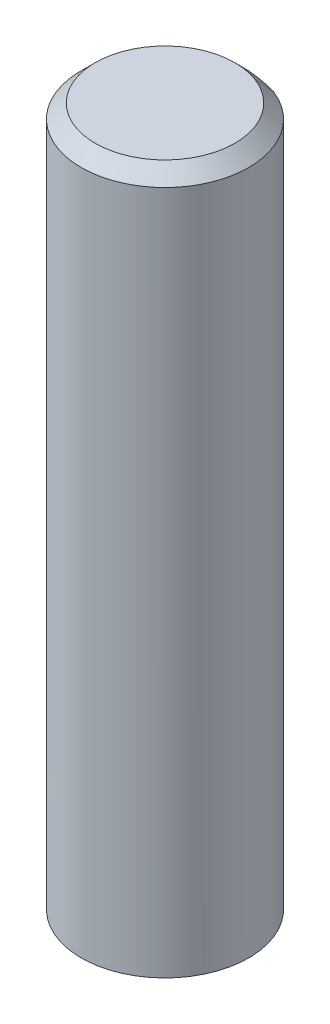
ISO-10303-21;
HEADER;
FILE_DESCRIPTION(('STEP AP214'),'2;1');
FILE_NAME('part.step','',(''),(''),'','','');
FILE_SCHEMA(('AUTOMOTIVE_DESIGN { 1 0 10303 214 1 1 1 1 }'));
ENDSEC;
DATA;
#1=APPLICATION_CONTEXT('core data for automotive mechanical design processes');
#2=APPLICATION_PROTOCOL_DEFINITION('international standard','automotive_design',2000,#1);
#3=PRODUCT_CONTEXT('',#1,'mechanical');
#4=PRODUCT('Part','Part','',(#3));
#5=PRODUCT_RELATED_PRODUCT_CATEGORY('part','',(#4));
#6=PRODUCT_DEFINITION_FORMATION('','',#4);
#7=PRODUCT_DEFINITION_CONTEXT('part definition',#1,'design');
#8=PRODUCT_DEFINITION('design','',#6,#7);
#9=PRODUCT_DEFINITION_SHAPE('','',#8);
#10=(LENGTH_UNIT() NAMED_UNIT(*) SI_UNIT(.MILLI.,.METRE.));
#11=(NAMED_UNIT(*) PLANE_ANGLE_UNIT() SI_UNIT($,.RADIAN.));
#12=(NAMED_UNIT(*) SI_UNIT($,.STERADIAN.) SOLID_ANGLE_UNIT());
#13=UNCERTAINTY_MEASURE_WITH_UNIT(LENGTH_MEASURE(1.E-05),#10,'distance_accuracy_value','');
#14=(GEOMETRIC_REPRESENTATION_CONTEXT(3) GLOBAL_UNCERTAINTY_ASSIGNED_CONTEXT((#13)) GLOBAL_UNIT_ASSIGNED_CONTEXT((#10,
#11,#12)) REPRESENTATION_CONTEXT('',''));
#15=CARTESIAN_POINT('',(0.,0.,0.));
#16=DIRECTION('',(0.,0.,1.));
#17=DIRECTION('',(1.,0.,0.));
#18=AXIS2_PLACEMENT_3D('',#15,#16,#17);
#19=CARTESIAN_POINT('',(3.96266032970383E-06,24.4970015062336,1.41741565208055E-06));
#20=DIRECTION('',(0.,-1.,0.));
#21=DIRECTION('',(1.,0.,0.));
#22=AXIS2_PLACEMENT_3D('',#19,#20,#21);
#23=CONICAL_SURFACE('',#22,3.00299983993226,0.785402046705377);
#24=CARTESIAN_POINT('',(0.897527026142766,24.9999987696679,-2.33333218496535));
#25=CARTESIAN_POINT('',(0.905006429369123,24.9791655616081,-2.3527766656029));
#26=CARTESIAN_POINT('',(0.912485833277227,24.9583323535484,-2.37222114597821));
#27=CARTESIAN_POINT('',(0.927444642456931,24.9166659374289,-2.41111010620437));
#28=CARTESIAN_POINT('',(0.934924047728531,24.8958327293692,-2.43055458605521));
#29=CARTESIAN_POINT('',(0.949882859635227,24.8541663132497,-2.46944354523242));
#30=CARTESIAN_POINT('',(0.957362266270322,24.8333331051899,-2.48888802455879));
#31=CARTESIAN_POINT('',(0.972321080904009,24.7916666890705,-2.52777698268705));
#32=CARTESIAN_POINT('',(0.9798004889026,24.7708334810107,-2.54722146148895));
#33=CARTESIAN_POINT('',(0.994759306263277,24.7291670648913,-2.58611041856826));
#34=CARTESIAN_POINT('',(1.00223871562536,24.7083338568315,-2.60555489684568));
#35=CARTESIAN_POINT('',(1.01719753571303,24.666667440712,-2.64444385287605));
#36=CARTESIAN_POINT('',(1.02467694643861,24.6458342326523,-2.663888330629));
#37=CARTESIAN_POINT('',(1.03963576925327,24.6041678165328,-2.70277728561042));
#38=CARTESIAN_POINT('',(1.04711518134235,24.5833346084731,-2.72222176283889));
#39=CARTESIAN_POINT('',(1.062074006884,24.5416681923536,-2.76111071677136));
#40=CARTESIAN_POINT('',(1.06955342033658,24.5208349842939,-2.78055519347536));
#41=CARTESIAN_POINT('',(1.0770328344709,24.5000017762341,-2.79999966991713));
#42=B_SPLINE_CURVE_WITH_KNOTS('',3,(#24,#25,#26,#27,#28,#29,#30,#31,#32,#33,#34,#35,#36,#37,#38,
#39,#40,#41),.UNSPECIFIED.,.F.,.F.,(4,2,2,2,2,2,2,2,4),(0.,0.0883881593966204,0.176776318793246,
0.265164478189871,0.353552637586502,0.441940796983131,0.530328956379764,0.618717115776401,
0.707105275173039),.UNSPECIFIED.);
#43=CARTESIAN_POINT('',(0.897526350395609,25.0000045074357,-2.3333368513676));
#44=VERTEX_POINT('',#43);
#45=CARTESIAN_POINT('',(1.07703242534803,24.5000062453026,-2.80000494365683));
#46=VERTEX_POINT('',#45);
#47=EDGE_CURVE('E33',#44,#46,#42,.T.);
#48=ORIENTED_EDGE('',*,*,#47,.T.);
#49=CARTESIAN_POINT('',(-1.07702837389864,24.5000002242888,-2.8));
#50=CARTESIAN_POINT('',(-0.988361503666712,24.5318607765706,-2.8));
#51=CARTESIAN_POINT('',(-0.898500591624331,24.5606729607833,-2.8));
#52=CARTESIAN_POINT('',(-0.716574744978598,24.6110759656766,-2.8));
#53=CARTESIAN_POINT('',(-0.62450535431952,24.6326505885143,-2.8));
#54=CARTESIAN_POINT('',(-0.441821941169993,24.6667275305204,-2.8));
#55=CARTESIAN_POINT('',(-0.351260782347426,24.6795067758955,-2.8));
#56=CARTESIAN_POINT('',(-0.169421208914261,24.6963352620021,-2.8));
#57=CARTESIAN_POINT('',(-0.0781437253270295,24.7003943974181,-2.8));
#58=CARTESIAN_POINT('',(0.10225633535318,24.6995508164255,-2.8));
#59=CARTESIAN_POINT('',(0.191379950969372,24.6948530941284,-2.8));
#60=CARTESIAN_POINT('',(0.368888279603076,24.6771875883131,-2.8));
#61=CARTESIAN_POINT('',(0.457272098342766,24.6642109468657,-2.8));
#62=CARTESIAN_POINT('',(0.635504288636282,24.6301635588202,-2.8));
#63=CARTESIAN_POINT('',(0.725302563913348,24.60883627128,-2.8));
#64=CARTESIAN_POINT('',(0.902785604201654,24.559297685735,-2.8));
#65=CARTESIAN_POINT('',(0.990474483112094,24.5311012261688,-2.8));
#66=CARTESIAN_POINT('',(1.07703095283914,24.5000021436772,-2.8));
#67=B_SPLINE_CURVE_WITH_KNOTS('',3,(#49,#50,#51,#52,#53,#54,#55,#56,#57,#58,#59,#60,#61,#62,#63,
#64,#65,#66),.UNSPECIFIED.,.F.,.F.,(4,2,2,2,2,2,2,2,4),(0.,0.282737314065222,0.56610324434768,
0.840079740268704,1.11374519125554,1.38108456230936,1.64871045068094,1.92530000808298,
2.20129730752298),.UNSPECIFIED.);
#68=CARTESIAN_POINT('',(-1.07703245897986,24.5000116030541,-2.79999875399439));
#69=VERTEX_POINT('',#68);
#70=EDGE_CURVE('E58',#69,#46,#67,.T.);
#71=ORIENTED_EDGE('',*,*,#70,.F.);
#72=CARTESIAN_POINT('',(-1.07702837341113,24.5000112303096,-2.79998820792932));
#73=CARTESIAN_POINT('',(-1.06954908170965,24.520844146978,-2.78054399660054));
#74=CARTESIAN_POINT('',(-1.06206978932644,24.5416770636465,-2.761099785534));
#75=CARTESIAN_POINT('',(-1.04711120319657,24.5833428969835,-2.72221136392538));
#76=CARTESIAN_POINT('',(-1.0396319094499,24.604175813652,-2.7027671533833));
#77=CARTESIAN_POINT('',(-1.02467332059312,24.6458416469889,-2.6638787328236));
#78=CARTESIAN_POINT('',(-1.017194025483,24.6666745636574,-2.64443452280598));
#79=CARTESIAN_POINT('',(-1.00223543389931,24.7083403969944,-2.60554610329519));
#80=CARTESIAN_POINT('',(-0.994756137425734,24.7291733136628,-2.58610189380203));
#81=CARTESIAN_POINT('',(-0.97979754311513,24.7708391469998,-2.54721347534017));
#82=CARTESIAN_POINT('',(-0.9723182452781,24.7916720636683,-2.52776926637147));
#83=CARTESIAN_POINT('',(-0.957359648240587,24.8333378970052,-2.48888084895852));
#84=CARTESIAN_POINT('',(-0.949880349040104,24.8541708136737,-2.46943664051428));
#85=CARTESIAN_POINT('',(-0.934921749275681,24.8958366470107,-2.43054822415026));
#86=CARTESIAN_POINT('',(-0.927442448711741,24.9166695636791,-2.41110401623048));
#87=CARTESIAN_POINT('',(-0.912483846220408,24.9583353970161,-2.37221560091537));
#88=CARTESIAN_POINT('',(-0.905004544293014,24.9791683136846,-2.35277139352005));
#89=CARTESIAN_POINT('',(-0.897525241683894,25.0000012303531,-2.33332718638696));
#90=B_SPLINE_CURVE_WITH_KNOTS('',3,(#72,#73,#74,#75,#76,#77,#78,#79,#80,#81,#82,#83,#84,#85,#86,
#87,#88,#89),.UNSPECIFIED.,.F.,.F.,(4,2,2,2,2,2,2,2,4),(0.,0.0883869231234219,0.176773846246841,
0.265160769370258,0.35354769249367,0.441934615617082,0.530321538740491,0.618708461863899,
0.707095384987304),.UNSPECIFIED.);
#91=CARTESIAN_POINT('',(-0.89754478982708,25.00000366244,-2.33332540171722));
#92=VERTEX_POINT('',#91);
#93=EDGE_CURVE('E127',#69,#92,#90,.T.);
#94=ORIENTED_EDGE('',*,*,#93,.T.);
#95=CARTESIAN_POINT('',(3.96266032970383E-06,25.,1.41741565323415E-06));
#96=DIRECTION('',(0.,1.,0.));
#97=DIRECTION('',(0.,0.,1.));
#98=AXIS2_PLACEMENT_3D('',#95,#96,#97);
#99=CIRCLE('',#98,2.49999743955459);
#100=EDGE_CURVE('E59',#44,#92,#99,.T.);
#101=ORIENTED_EDGE('',*,*,#100,.F.);
#102=EDGE_LOOP('',(#48,#71,#94,#101));
#103=FACE_BOUND('',#102,.T.);
#104=ADVANCED_FACE('F15',(#103),#23,.T.);
#105=CARTESIAN_POINT('',(0.,25.,0.));
#106=DIRECTION('',(0.,1.,0.));
#107=DIRECTION('',(0.,0.,1.));
#108=AXIS2_PLACEMENT_3D('',#105,#106,#107);
#109=PLANE('',#108);
#110=ORIENTED_EDGE('',*,*,#100,.T.);
#111=CARTESIAN_POINT('',(-4.41605694229922E-06,25.,-2.31559280090398E-05));
#112=DIRECTION('',(0.,1.,0.));
#113=DIRECTION('',(0.,0.,1.));
#114=AXIS2_PLACEMENT_3D('',#111,#112,#113);
#115=CIRCLE('',#114,2.49999585677121);
#116=EDGE_CURVE('E67',#44,#92,#115,.F.);
#117=ORIENTED_EDGE('',*,*,#116,.F.);
#118=EDGE_LOOP('',(#110,#117));
#119=FACE_BOUND('',#118,.T.);
#120=ADVANCED_FACE('F135',(#119),#109,.T.);
#121=CARTESIAN_POINT('',(0.,0.,0.));
#122=DIRECTION('',(0.,1.,0.));
#123=DIRECTION('',(0.,0.,1.));
#124=AXIS2_PLACEMENT_3D('',#121,#122,#123);
#125=PLANE('',#124);
#126=CARTESIAN_POINT('',(0.,0.,0.));
#127=DIRECTION('',(0.,1.,0.));
#128=DIRECTION('',(0.,0.,1.));
#129=AXIS2_PLACEMENT_3D('',#126,#127,#128);
#130=CIRCLE('',#129,3.);
#131=CARTESIAN_POINT('',(-1.0770329614269,0.,-2.8));
#132=VERTEX_POINT('',#131);
#133=CARTESIAN_POINT('',(1.0770329614269,0.,-2.8));
#134=VERTEX_POINT('',#133);
#135=EDGE_CURVE('E61',#132,#134,#130,.T.);
#136=ORIENTED_EDGE('',*,*,#135,.F.);
#137=DIRECTION('',(-1.,0.,0.));
#138=VECTOR('',#137,1.);
#139=CARTESIAN_POINT('',(1.0770329614269,0.,-2.8));
#140=LINE('',#139,#138);
#141=EDGE_CURVE('E50',#134,#132,#140,.T.);
#142=ORIENTED_EDGE('',*,*,#141,.F.);
#143=EDGE_LOOP('',(#136,#142));
#144=FACE_BOUND('',#143,.T.);
#145=ADVANCED_FACE('F62',(#144),#125,.F.);
#146=CARTESIAN_POINT('',(1.0770329614269,0.,-2.8));
#147=DIRECTION('',(0.,0.,-1.));
#148=DIRECTION('',(-1.,0.,0.));
#149=AXIS2_PLACEMENT_3D('',#146,#147,#148);
#150=PLANE('',#149);
#151=DIRECTION('',(0.,1.,0.));
#152=VECTOR('',#151,1.);
#153=CARTESIAN_POINT('',(-1.0770329614269,0.,-2.8));
#154=LINE('',#153,#152);
#155=EDGE_CURVE('E54',#69,#132,#154,.F.);
#156=ORIENTED_EDGE('',*,*,#155,.F.);
#157=ORIENTED_EDGE('',*,*,#70,.T.);
#158=DIRECTION('',(0.,1.,0.));
#159=VECTOR('',#158,1.);
#160=CARTESIAN_POINT('',(1.0770329614269,0.,-2.8));
#161=LINE('',#160,#159);
#162=EDGE_CURVE('E25',#134,#46,#161,.T.);
#163=ORIENTED_EDGE('',*,*,#162,.F.);
#164=ORIENTED_EDGE('',*,*,#141,.T.);
#165=EDGE_LOOP('',(#156,#157,#163,#164));
#166=FACE_BOUND('',#165,.T.);
#167=ADVANCED_FACE('F52',(#166),#150,.T.);
#168=CARTESIAN_POINT('',(-4.41605694229922E-06,24.5000115080529,-2.31559280090398E-05));
#169=DIRECTION('',(0.,-1.,0.));
#170=DIRECTION('',(0.,0.,-1.));
#171=AXIS2_PLACEMENT_3D('',#168,#169,#170);
#172=CONICAL_SURFACE('',#171,2.99998847092447,0.785402285681521);
#173=ORIENTED_EDGE('',*,*,#47,.F.);
#174=ORIENTED_EDGE('',*,*,#116,.T.);
#175=ORIENTED_EDGE('',*,*,#93,.F.);
#176=CARTESIAN_POINT('',(1.07703083799338,24.5000200056775,-2.80000081678761));
#177=CARTESIAN_POINT('',(1.14639955240836,24.5000196976141,-2.77331842198067));
#178=CARTESIAN_POINT('',(1.214752418303,24.5000193712036,-2.74406530991699));
#179=CARTESIAN_POINT('',(1.34909178053737,24.5000186833819,-2.68057319634131));
#180=CARTESIAN_POINT('',(1.4150785603789,24.5000183219748,-2.64633479466581));
#181=CARTESIAN_POINT('',(1.60896583778062,24.5000171879536,-2.53639085168125));
#182=CARTESIAN_POINT('',(1.7328439086266,24.5000163653142,-2.45343705591407));
#183=CARTESIAN_POINT('',(1.98268586722451,24.5000144870734,-2.25774534160753));
#184=CARTESIAN_POINT('',(2.10668913662099,24.5000134150204,-2.14250207150679));
#185=CARTESIAN_POINT('',(2.33358903156711,24.5000111539231,-1.89283308051105));
#186=CARTESIAN_POINT('',(2.43648517577291,24.5000099648761,-1.75840692227258));
#187=CARTESIAN_POINT('',(2.61824371659059,24.5000075036077,-1.4741950985176));
#188=CARTESIAN_POINT('',(2.69710749442836,24.5000062313911,-1.32441031637759));
#189=CARTESIAN_POINT('',(2.82857617823767,24.5000036397211,-1.01371285186865));
#190=CARTESIAN_POINT('',(2.88117866319533,24.5000023202633,-0.852799145086709));
#191=CARTESIAN_POINT('',(2.95861977755237,24.4999996717087,-0.524427841090968));
#192=CARTESIAN_POINT('',(2.98345901661094,24.499998342612,-0.356970387656307));
#193=CARTESIAN_POINT('',(3.00467002753436,24.4999957125458,-0.0202703189590446));
#194=CARTESIAN_POINT('',(3.00104317277234,24.4999944115749,0.148972209787515));
#195=CARTESIAN_POINT('',(2.96542795062729,24.499991874603,0.484448924722978));
#196=CARTESIAN_POINT('',(2.93343915119405,24.499990638603,0.650683065044388));
#197=CARTESIAN_POINT('',(2.84200667197843,24.4999882666587,0.975424417137711));
#198=CARTESIAN_POINT('',(2.78256250405069,24.4999871307163,1.13393149147011));
#199=CARTESIAN_POINT('',(2.63790704781624,24.4999849911646,1.43871497419215));
#200=CARTESIAN_POINT('',(2.55269591738303,24.4999839875546,1.5849914575113));
#201=CARTESIAN_POINT('',(2.35892585270392,24.499982141154,1.86116170037487));
#202=CARTESIAN_POINT('',(2.25036704748831,24.4999812983626,1.99105555045118));
#203=CARTESIAN_POINT('',(2.01298276341998,24.4999797975145,2.23077443070964));
#204=CARTESIAN_POINT('',(1.88415724389509,24.4999791394582,2.34059942061571));
#205=CARTESIAN_POINT('',(1.60989645288285,24.4999780267617,2.5370628026253));
#206=CARTESIAN_POINT('',(1.4644611562726,24.4999775721219,2.62370115965752));
#207=CARTESIAN_POINT('',(1.16110954468651,24.4999768791656,2.77133160152801));
#208=CARTESIAN_POINT('',(1.00319323701364,24.499976640849,2.83232370137246));
#209=CARTESIAN_POINT('',(0.679362365590126,24.4999763873037,2.92693029929002));
#210=CARTESIAN_POINT('',(0.51344780457783,24.499976372075,2.9605448067363));
#211=CARTESIAN_POINT('',(0.178330169150345,24.4999765651375,2.99944204182843));
#212=CARTESIAN_POINT('',(0.00912709410622289,24.4999767734289,3.00472476405573));
#213=CARTESIAN_POINT('',(-0.327764353644968,24.499977407619,2.98680845347996));
#214=CARTESIAN_POINT('',(-0.495452726412884,24.4999778335178,2.96360942182105));
#215=CARTESIAN_POINT('',(-0.824554565136926,24.499978890833,2.88938816490794));
#216=CARTESIAN_POINT('',(-0.985968032296718,24.4999795222493,2.83836594499088));
#217=CARTESIAN_POINT('',(-1.29793810839815,24.4999809726763,2.70994665799899));
#218=CARTESIAN_POINT('',(-1.44849471273836,24.499981791687,2.63254957974586));
#219=CARTESIAN_POINT('',(-1.73447719821352,24.499983594054,2.45357761234159));
#220=CARTESIAN_POINT('',(-1.86990307179649,24.4999845774105,2.35200271112302));
#221=CARTESIAN_POINT('',(-2.12177948133402,24.4999866805531,2.1275586954249));
#222=CARTESIAN_POINT('',(-2.23823004427138,24.4999878003391,2.00468961122609));
#223=CARTESIAN_POINT('',(-2.44885024972549,24.4999901445533,1.74114518460063));
#224=CARTESIAN_POINT('',(-2.54301992026297,24.4999913689815,1.60046986456768));
#225=CARTESIAN_POINT('',(-2.70640566075626,24.4999938877289,1.3053056032449));
#226=CARTESIAN_POINT('',(-2.77562163246046,24.4999951820485,1.15081660756871));
#227=CARTESIAN_POINT('',(-2.88713472858294,24.4999978038349,0.832410660159991));
#228=CARTESIAN_POINT('',(-2.92943179954151,24.4999991313019,0.668493689704642));
#229=CARTESIAN_POINT('',(-2.98590592213004,24.5000017816873,0.335886536391103));
#230=CARTESIAN_POINT('',(-3.00008319616221,24.5000031046056,0.167196391295115));
#231=CARTESIAN_POINT('',(-2.99991606682034,24.500005708355,-0.170170313007713));
#232=CARTESIAN_POINT('',(-2.98557156308473,24.5000069891859,-0.338846872164658));
#233=CARTESIAN_POINT('',(-2.92876740154068,24.5000094723984,-0.671397955346277));
#234=CARTESIAN_POINT('',(-2.88630771922556,24.50001067478,-0.835272475185107));
#235=CARTESIAN_POINT('',(-2.77448308690542,24.5000129668959,-1.1535581986319));
#236=CARTESIAN_POINT('',(-2.70511954802241,24.5000140566362,-1.30796989807817));
#237=CARTESIAN_POINT('',(-2.54144124613979,24.5000160927306,-1.60297493691207));
#238=CARTESIAN_POINT('',(-2.44712388844759,24.5000170390698,-1.74356683723381));
#239=CARTESIAN_POINT('',(-2.2362079220289,24.5000187615815,-2.00695354870765));
#240=CARTESIAN_POINT('',(-2.1196021842573,24.5000195376993,-2.12974264338904));
#241=CARTESIAN_POINT('',(-1.86744988321831,24.5000208970286,-2.35394065034324));
#242=CARTESIAN_POINT('',(-1.73191748709122,24.5000214803832,-2.45536541328162));
#243=CARTESIAN_POINT('',(-1.50787317320149,24.5000222305474,-2.59528150595081));
#244=CARTESIAN_POINT('',(-1.42439388862975,24.5000224683714,-2.64201347020151));
#245=CARTESIAN_POINT('',(-1.25350955216347,24.5000228746236,-2.72723537796486));
#246=CARTESIAN_POINT('',(-1.16611153464439,24.500023043171,-2.76573942679776));
#247=CARTESIAN_POINT('',(-1.07703294126251,24.5000231764907,-2.80000000775633));
#248=B_SPLINE_CURVE_WITH_KNOTS('',3,(#176,#177,#178,#179,#180,#181,#182,#183,#184,#185,#186,
#187,#188,#189,#190,#191,#192,#193,#194,#195,#196,#197,#198,#199,#200,#201,#202,#203,#204,#205,
#206,#207,#208,#209,#210,#211,#212,#213,#214,#215,#216,#217,#218,#219,#220,#221,#222,#223,#224,
#225,#226,#227,#228,#229,#230,#231,#232,#233,#234,#235,#236,#237,#238,#239,#240,#241,#242,#243,
#244,#245,#246,#247),.UNSPECIFIED.,.F.,.F.,(4,2,2,2,2,2,2,2,2,2,2,2,2,2,2,2,2,2,2,2,2,2,2,2,2,2,
2,2,2,2,2,2,2,2,2,4),(0.,0.222868739287643,0.445710684844992,0.891233408245812,1.39668144035781,
1.90214099783131,2.4075714992577,2.91304858743813,3.41851457551829,3.92395617707214,
4.42940547837659,4.93486376671134,5.44031895817908,5.94577135633442,6.45122476886802,
6.9566789459286,7.46213282723658,7.96758653549396,8.47304034042098,8.97849412504326,
9.48394781270779,9.98940171459627,10.4948558687635,11.0003093041712,11.5057621039108,
12.0112168937765,12.5166726874493,13.0221244834074,13.5275780579374,14.0330320730481,
14.5384595804035,15.0439396626684,15.5495816965329,16.0548472517712,16.3414645580591,
16.6275864956697),.UNSPECIFIED.);
#249=EDGE_CURVE('E10',#46,#69,#248,.T.);
#250=ORIENTED_EDGE('',*,*,#249,.F.);
#251=EDGE_LOOP('',(#173,#174,#175,#250));
#252=FACE_BOUND('',#251,.T.);
#253=ADVANCED_FACE('F92',(#252),#172,.T.);
#254=CARTESIAN_POINT('',(0.,0.,0.));
#255=DIRECTION('',(0.,1.,0.));
#256=DIRECTION('',(0.,0.,1.));
#257=AXIS2_PLACEMENT_3D('',#254,#255,#256);
#258=CYLINDRICAL_SURFACE('',#257,3.);
#259=ORIENTED_EDGE('',*,*,#162,.T.);
#260=ORIENTED_EDGE('',*,*,#249,.T.);
#261=ORIENTED_EDGE('',*,*,#155,.T.);
#262=ORIENTED_EDGE('',*,*,#135,.T.);
#263=EDGE_LOOP('',(#259,#260,#261,#262));
#264=FACE_BOUND('',#263,.T.);
#265=ADVANCED_FACE('F65',(#264),#258,.T.);
#266=CLOSED_SHELL('',(#104,#120,#145,#167,#253,#265));
#267=MANIFOLD_SOLID_BREP('B1',#266);
#268=ADVANCED_BREP_SHAPE_REPRESENTATION('',(#18,#267),#14);
#269=SHAPE_DEFINITION_REPRESENTATION(#9,#268);
ENDSEC;
END-ISO-10303-21;
